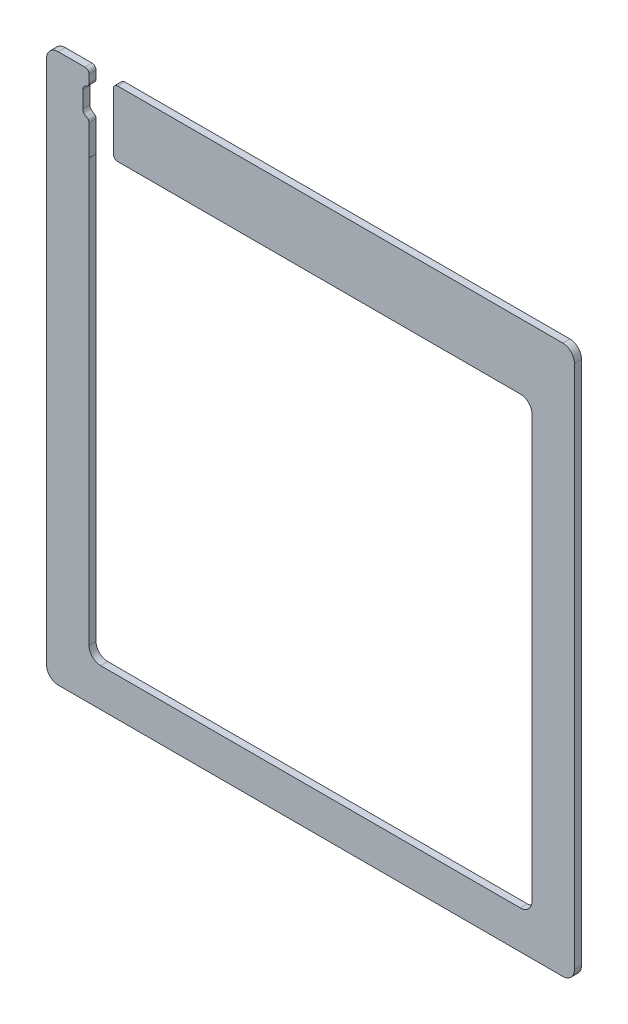
ISO-10303-21;
HEADER;
FILE_DESCRIPTION(('STEP AP214'),'2;1');
FILE_NAME('part.step','',(''),(''),'','','');
FILE_SCHEMA(('AUTOMOTIVE_DESIGN { 1 0 10303 214 1 1 1 1 }'));
ENDSEC;
DATA;
#1=APPLICATION_CONTEXT('core data for automotive mechanical design processes');
#2=APPLICATION_PROTOCOL_DEFINITION('international standard','automotive_design',2000,#1);
#3=PRODUCT_CONTEXT('',#1,'mechanical');
#4=PRODUCT('Part','Part','',(#3));
#5=PRODUCT_RELATED_PRODUCT_CATEGORY('part','',(#4));
#6=PRODUCT_DEFINITION_FORMATION('','',#4);
#7=PRODUCT_DEFINITION_CONTEXT('part definition',#1,'design');
#8=PRODUCT_DEFINITION('design','',#6,#7);
#9=PRODUCT_DEFINITION_SHAPE('','',#8);
#10=(LENGTH_UNIT() NAMED_UNIT(*) SI_UNIT(.MILLI.,.METRE.));
#11=(NAMED_UNIT(*) PLANE_ANGLE_UNIT() SI_UNIT($,.RADIAN.));
#12=(NAMED_UNIT(*) SI_UNIT($,.STERADIAN.) SOLID_ANGLE_UNIT());
#13=UNCERTAINTY_MEASURE_WITH_UNIT(LENGTH_MEASURE(1.E-05),#10,'distance_accuracy_value','');
#14=(GEOMETRIC_REPRESENTATION_CONTEXT(3) GLOBAL_UNCERTAINTY_ASSIGNED_CONTEXT((#13)) GLOBAL_UNIT_ASSIGNED_CONTEXT((#10,
#11,#12)) REPRESENTATION_CONTEXT('',''));
#15=CARTESIAN_POINT('',(0.,0.,0.));
#16=DIRECTION('',(0.,0.,1.));
#17=DIRECTION('',(1.,0.,0.));
#18=AXIS2_PLACEMENT_3D('',#15,#16,#17);
#19=CARTESIAN_POINT('',(-161.925,168.275,4.3434));
#20=DIRECTION('',(0.,-1.,0.));
#21=DIRECTION('',(0.,0.,-1.));
#22=AXIS2_PLACEMENT_3D('',#19,#20,#21);
#23=PLANE('',#22);
#24=DIRECTION('',(-1.,0.,0.));
#25=VECTOR('',#24,1.);
#26=CARTESIAN_POINT('',(-161.925,168.275,4.3434));
#27=LINE('',#26,#25);
#28=CARTESIAN_POINT('',(-138.43,168.275,4.3434));
#29=VERTEX_POINT('',#28);
#30=CARTESIAN_POINT('',(-154.78125,168.275,4.3434));
#31=VERTEX_POINT('',#30);
#32=EDGE_CURVE('E356',#29,#31,#27,.T.);
#33=ORIENTED_EDGE('',*,*,#32,.F.);
#34=DIRECTION('',(0.,0.,1.));
#35=VECTOR('',#34,1.);
#36=CARTESIAN_POINT('',(-138.43,168.275,4.3434));
#37=LINE('',#36,#35);
#38=CARTESIAN_POINT('',(-138.43,168.275,0.));
#39=VERTEX_POINT('',#38);
#40=EDGE_CURVE('E490',#29,#39,#37,.F.);
#41=ORIENTED_EDGE('',*,*,#40,.T.);
#42=DIRECTION('',(-1.,0.,0.));
#43=VECTOR('',#42,1.);
#44=CARTESIAN_POINT('',(-161.925,168.275,0.));
#45=LINE('',#44,#43);
#46=CARTESIAN_POINT('',(-154.78125,168.275,0.));
#47=VERTEX_POINT('',#46);
#48=EDGE_CURVE('E369',#39,#47,#45,.T.);
#49=ORIENTED_EDGE('',*,*,#48,.T.);
#50=DIRECTION('',(0.,0.,-1.));
#51=VECTOR('',#50,1.);
#52=CARTESIAN_POINT('',(-154.78125,168.275,4.3434));
#53=LINE('',#52,#51);
#54=EDGE_CURVE('E428',#47,#31,#53,.F.);
#55=ORIENTED_EDGE('',*,*,#54,.T.);
#56=EDGE_LOOP('',(#33,#41,#49,#55));
#57=FACE_BOUND('',#56,.T.);
#58=ADVANCED_FACE('F37',(#57),#23,.F.);
#59=CARTESIAN_POINT('',(161.925,-168.275,4.3434));
#60=DIRECTION('',(-1.,0.,0.));
#61=DIRECTION('',(0.,0.,1.));
#62=AXIS2_PLACEMENT_3D('',#59,#60,#61);
#63=PLANE('',#62);
#64=DIRECTION('',(0.,1.,0.));
#65=VECTOR('',#64,1.);
#66=CARTESIAN_POINT('',(161.925,-168.275,4.3434));
#67=LINE('',#66,#65);
#68=CARTESIAN_POINT('',(161.925,-161.13125,4.3434));
#69=VERTEX_POINT('',#68);
#70=CARTESIAN_POINT('',(161.925,161.13125,4.3434));
#71=VERTEX_POINT('',#70);
#72=EDGE_CURVE('E353',#69,#71,#67,.T.);
#73=ORIENTED_EDGE('',*,*,#72,.F.);
#74=DIRECTION('',(0.,0.,-1.));
#75=VECTOR('',#74,1.);
#76=CARTESIAN_POINT('',(161.925,-161.13125,4.3434));
#77=LINE('',#76,#75);
#78=CARTESIAN_POINT('',(161.925,-161.13125,0.));
#79=VERTEX_POINT('',#78);
#80=EDGE_CURVE('E425',#69,#79,#77,.T.);
#81=ORIENTED_EDGE('',*,*,#80,.T.);
#82=DIRECTION('',(0.,1.,0.));
#83=VECTOR('',#82,1.);
#84=CARTESIAN_POINT('',(161.925,-168.275,0.));
#85=LINE('',#84,#83);
#86=CARTESIAN_POINT('',(161.925,161.13125,0.));
#87=VERTEX_POINT('',#86);
#88=EDGE_CURVE('E342',#79,#87,#85,.T.);
#89=ORIENTED_EDGE('',*,*,#88,.T.);
#90=DIRECTION('',(0.,0.,-1.));
#91=VECTOR('',#90,1.);
#92=CARTESIAN_POINT('',(161.925,161.13125,4.3434));
#93=LINE('',#92,#91);
#94=EDGE_CURVE('E423',#87,#71,#93,.F.);
#95=ORIENTED_EDGE('',*,*,#94,.T.);
#96=EDGE_LOOP('',(#73,#81,#89,#95));
#97=FACE_BOUND('',#96,.T.);
#98=ADVANCED_FACE('F598',(#97),#63,.F.);
#99=CARTESIAN_POINT('',(154.78125,168.275,0.));
#100=VERTEX_POINT('',#99);
#101=CARTESIAN_POINT('',(-118.370344445739,168.275,0.));
#102=VERTEX_POINT('',#101);
#103=EDGE_CURVE('E370',#100,#102,#45,.T.);
#104=ORIENTED_EDGE('',*,*,#103,.T.);
#105=DIRECTION('',(0.,0.,1.));
#106=VECTOR('',#105,1.);
#107=CARTESIAN_POINT('',(-118.370344445739,168.275,4.3434));
#108=LINE('',#107,#106);
#109=CARTESIAN_POINT('',(-118.370344445739,168.275,4.3434));
#110=VERTEX_POINT('',#109);
#111=EDGE_CURVE('E492',#102,#110,#108,.T.);
#112=ORIENTED_EDGE('',*,*,#111,.T.);
#113=CARTESIAN_POINT('',(154.78125,168.275,4.3434));
#114=VERTEX_POINT('',#113);
#115=EDGE_CURVE('E358',#114,#110,#27,.T.);
#116=ORIENTED_EDGE('',*,*,#115,.F.);
#117=DIRECTION('',(0.,0.,-1.));
#118=VECTOR('',#117,1.);
#119=CARTESIAN_POINT('',(154.78125,168.275,4.3434));
#120=LINE('',#119,#118);
#121=EDGE_CURVE('E431',#114,#100,#120,.T.);
#122=ORIENTED_EDGE('',*,*,#121,.T.);
#123=EDGE_LOOP('',(#104,#112,#116,#122));
#124=FACE_BOUND('',#123,.T.);
#125=ADVANCED_FACE('F606',(#124),#23,.F.);
#126=CARTESIAN_POINT('',(-161.925,-168.275,4.3434));
#127=DIRECTION('',(1.,0.,0.));
#128=DIRECTION('',(0.,0.,-1.));
#129=AXIS2_PLACEMENT_3D('',#126,#127,#128);
#130=PLANE('',#129);
#131=DIRECTION('',(0.,-1.,0.));
#132=VECTOR('',#131,1.);
#133=CARTESIAN_POINT('',(-161.925,-168.275,0.));
#134=LINE('',#133,#132);
#135=CARTESIAN_POINT('',(-161.925,161.13125,0.));
#136=VERTEX_POINT('',#135);
#137=CARTESIAN_POINT('',(-161.925,-161.13125,0.));
#138=VERTEX_POINT('',#137);
#139=EDGE_CURVE('E373',#136,#138,#134,.T.);
#140=ORIENTED_EDGE('',*,*,#139,.T.);
#141=DIRECTION('',(0.,0.,-1.));
#142=VECTOR('',#141,1.);
#143=CARTESIAN_POINT('',(-161.925,-161.13125,4.3434));
#144=LINE('',#143,#142);
#145=CARTESIAN_POINT('',(-161.925,-161.13125,4.3434));
#146=VERTEX_POINT('',#145);
#147=EDGE_CURVE('E413',#138,#146,#144,.F.);
#148=ORIENTED_EDGE('',*,*,#147,.T.);
#149=DIRECTION('',(0.,-1.,0.));
#150=VECTOR('',#149,1.);
#151=CARTESIAN_POINT('',(-161.925,-168.275,4.3434));
#152=LINE('',#151,#150);
#153=CARTESIAN_POINT('',(-161.925,161.13125,4.3434));
#154=VERTEX_POINT('',#153);
#155=EDGE_CURVE('E360',#154,#146,#152,.T.);
#156=ORIENTED_EDGE('',*,*,#155,.F.);
#157=DIRECTION('',(0.,0.,-1.));
#158=VECTOR('',#157,1.);
#159=CARTESIAN_POINT('',(-161.925,161.13125,4.3434));
#160=LINE('',#159,#158);
#161=EDGE_CURVE('E410',#154,#136,#160,.T.);
#162=ORIENTED_EDGE('',*,*,#161,.T.);
#163=EDGE_LOOP('',(#140,#148,#156,#162));
#164=FACE_BOUND('',#163,.T.);
#165=ADVANCED_FACE('F580',(#164),#130,.F.);
#166=CARTESIAN_POINT('',(-161.925,-168.275,4.3434));
#167=DIRECTION('',(0.,1.,0.));
#168=DIRECTION('',(0.,0.,1.));
#169=AXIS2_PLACEMENT_3D('',#166,#167,#168);
#170=PLANE('',#169);
#171=DIRECTION('',(1.,0.,0.));
#172=VECTOR('',#171,1.);
#173=CARTESIAN_POINT('',(-161.925,-168.275,4.3434));
#174=LINE('',#173,#172);
#175=CARTESIAN_POINT('',(-154.78125,-168.275,4.3434));
#176=VERTEX_POINT('',#175);
#177=CARTESIAN_POINT('',(154.78125,-168.275,4.3434));
#178=VERTEX_POINT('',#177);
#179=EDGE_CURVE('E363',#176,#178,#174,.T.);
#180=ORIENTED_EDGE('',*,*,#179,.F.);
#181=DIRECTION('',(0.,0.,-1.));
#182=VECTOR('',#181,1.);
#183=CARTESIAN_POINT('',(-154.78125,-168.275,4.3434));
#184=LINE('',#183,#182);
#185=CARTESIAN_POINT('',(-154.78125,-168.275,0.));
#186=VERTEX_POINT('',#185);
#187=EDGE_CURVE('E398',#176,#186,#184,.T.);
#188=ORIENTED_EDGE('',*,*,#187,.T.);
#189=DIRECTION('',(1.,0.,0.));
#190=VECTOR('',#189,1.);
#191=CARTESIAN_POINT('',(-161.925,-168.275,0.));
#192=LINE('',#191,#190);
#193=CARTESIAN_POINT('',(154.78125,-168.275,0.));
#194=VERTEX_POINT('',#193);
#195=EDGE_CURVE('E357',#186,#194,#192,.T.);
#196=ORIENTED_EDGE('',*,*,#195,.T.);
#197=DIRECTION('',(0.,0.,-1.));
#198=VECTOR('',#197,1.);
#199=CARTESIAN_POINT('',(154.78125,-168.275,4.3434));
#200=LINE('',#199,#198);
#201=EDGE_CURVE('E396',#194,#178,#200,.F.);
#202=ORIENTED_EDGE('',*,*,#201,.T.);
#203=EDGE_LOOP('',(#180,#188,#196,#202));
#204=FACE_BOUND('',#203,.T.);
#205=ADVANCED_FACE('F589',(#204),#170,.F.);
#206=CARTESIAN_POINT('',(0.,0.,4.3434));
#207=DIRECTION('',(0.,0.,-1.));
#208=DIRECTION('',(-1.,0.,0.));
#209=AXIS2_PLACEMENT_3D('',#206,#207,#208);
#210=PLANE('',#209);
#211=DIRECTION('',(0.,-1.,0.));
#212=VECTOR('',#211,1.);
#213=CARTESIAN_POINT('',(-135.89,168.275,4.3434));
#214=LINE('',#213,#212);
#215=CARTESIAN_POINT('',(-135.89,140.026846327358,4.3434));
#216=VERTEX_POINT('',#215);
#217=CARTESIAN_POINT('',(-135.89,121.34990390463,4.3434));
#218=VERTEX_POINT('',#217);
#219=EDGE_CURVE('E270',#216,#218,#214,.T.);
#220=ORIENTED_EDGE('',*,*,#219,.F.);
#221=CARTESIAN_POINT('',(-138.43,140.026846327358,4.3434));
#222=DIRECTION('',(0.,0.,-1.));
#223=DIRECTION('',(-1.,0.,0.));
#224=AXIS2_PLACEMENT_3D('',#221,#222,#223);
#225=CIRCLE('',#224,2.54);
#226=CARTESIAN_POINT('',(-137.583333333333,142.421581292977,4.3434));
#227=VERTEX_POINT('',#226);
#228=EDGE_CURVE('E481',#216,#227,#225,.F.);
#229=ORIENTED_EDGE('',*,*,#228,.T.);
#230=CARTESIAN_POINT('',(-136.525,145.415,4.3434));
#231=DIRECTION('',(0.,0.,1.));
#232=DIRECTION('',(1.,0.,0.));
#233=AXIS2_PLACEMENT_3D('',#230,#231,#232);
#234=CIRCLE('',#233,3.17500000000001);
#235=CARTESIAN_POINT('',(-139.7,145.415,4.3434));
#236=VERTEX_POINT('',#235);
#237=EDGE_CURVE('E274',#236,#227,#234,.T.);
#238=ORIENTED_EDGE('',*,*,#237,.F.);
#239=DIRECTION('',(0.,-1.,0.));
#240=VECTOR('',#239,1.);
#241=CARTESIAN_POINT('',(-139.7,145.415,4.3434));
#242=LINE('',#241,#240);
#243=CARTESIAN_POINT('',(-139.7,155.575,4.3434));
#244=VERTEX_POINT('',#243);
#245=EDGE_CURVE('E303',#244,#236,#242,.T.);
#246=ORIENTED_EDGE('',*,*,#245,.F.);
#247=CARTESIAN_POINT('',(-136.525,155.575,4.3434));
#248=DIRECTION('',(0.,0.,1.));
#249=DIRECTION('',(1.,0.,0.));
#250=AXIS2_PLACEMENT_3D('',#247,#248,#249);
#251=CIRCLE('',#250,3.17500000000001);
#252=CARTESIAN_POINT('',(-137.583333333333,158.568418707023,4.3434));
#253=VERTEX_POINT('',#252);
#254=EDGE_CURVE('E314',#253,#244,#251,.T.);
#255=ORIENTED_EDGE('',*,*,#254,.F.);
#256=CARTESIAN_POINT('',(-138.43,160.963153672642,4.3434));
#257=DIRECTION('',(0.,0.,-1.));
#258=DIRECTION('',(-1.,0.,0.));
#259=AXIS2_PLACEMENT_3D('',#256,#257,#258);
#260=CIRCLE('',#259,2.54);
#261=CARTESIAN_POINT('',(-135.89,160.963153672642,4.3434));
#262=VERTEX_POINT('',#261);
#263=EDGE_CURVE('E473',#253,#262,#260,.F.);
#264=ORIENTED_EDGE('',*,*,#263,.T.);
#265=CARTESIAN_POINT('',(-135.89,165.735,4.3434));
#266=VERTEX_POINT('',#265);
#267=EDGE_CURVE('E290',#266,#262,#214,.T.);
#268=ORIENTED_EDGE('',*,*,#267,.F.);
#269=CARTESIAN_POINT('',(-138.43,165.735,4.3434));
#270=DIRECTION('',(0.,0.,-1.));
#271=DIRECTION('',(-1.,0.,0.));
#272=AXIS2_PLACEMENT_3D('',#269,#270,#271);
#273=CIRCLE('',#272,2.54);
#274=EDGE_CURVE('E479',#266,#29,#273,.F.);
#275=ORIENTED_EDGE('',*,*,#274,.T.);
#276=ORIENTED_EDGE('',*,*,#32,.T.);
#277=CARTESIAN_POINT('',(-154.78125,161.13125,4.3434));
#278=DIRECTION('',(0.,0.,-1.));
#279=DIRECTION('',(-1.,0.,0.));
#280=AXIS2_PLACEMENT_3D('',#277,#278,#279);
#281=CIRCLE('',#280,7.14375);
#282=EDGE_CURVE('E415',#31,#154,#281,.F.);
#283=ORIENTED_EDGE('',*,*,#282,.T.);
#284=ORIENTED_EDGE('',*,*,#155,.T.);
#285=CARTESIAN_POINT('',(-154.78125,-161.13125,4.3434));
#286=DIRECTION('',(0.,0.,-1.));
#287=DIRECTION('',(-1.,0.,0.));
#288=AXIS2_PLACEMENT_3D('',#285,#286,#287);
#289=CIRCLE('',#288,7.14375);
#290=EDGE_CURVE('E421',#146,#176,#289,.F.);
#291=ORIENTED_EDGE('',*,*,#290,.T.);
#292=ORIENTED_EDGE('',*,*,#179,.T.);
#293=CARTESIAN_POINT('',(154.78125,-161.13125,4.3434));
#294=DIRECTION('',(0.,0.,-1.));
#295=DIRECTION('',(-1.,0.,0.));
#296=AXIS2_PLACEMENT_3D('',#293,#294,#295);
#297=CIRCLE('',#296,7.14375);
#298=EDGE_CURVE('E419',#178,#69,#297,.F.);
#299=ORIENTED_EDGE('',*,*,#298,.T.);
#300=ORIENTED_EDGE('',*,*,#72,.T.);
#301=CARTESIAN_POINT('',(154.78125,161.13125,4.3434));
#302=DIRECTION('',(0.,0.,-1.));
#303=DIRECTION('',(-1.,0.,0.));
#304=AXIS2_PLACEMENT_3D('',#301,#302,#303);
#305=CIRCLE('',#304,7.14375);
#306=EDGE_CURVE('E417',#71,#114,#305,.F.);
#307=ORIENTED_EDGE('',*,*,#306,.T.);
#308=ORIENTED_EDGE('',*,*,#115,.T.);
#309=CARTESIAN_POINT('',(-118.370344445739,165.735,4.3434));
#310=DIRECTION('',(0.,0.,-1.));
#311=DIRECTION('',(-1.,0.,0.));
#312=AXIS2_PLACEMENT_3D('',#309,#310,#311);
#313=CIRCLE('',#312,2.54);
#314=CARTESIAN_POINT('',(-120.910344445739,165.735,4.3434));
#315=VERTEX_POINT('',#314);
#316=EDGE_CURVE('E62',#110,#315,#313,.F.);
#317=ORIENTED_EDGE('',*,*,#316,.T.);
#318=DIRECTION('',(0.,1.,0.));
#319=VECTOR('',#318,1.);
#320=CARTESIAN_POINT('',(-120.910344445739,168.275,4.3434));
#321=LINE('',#320,#319);
#322=CARTESIAN_POINT('',(-120.910344445739,130.683,4.3434));
#323=VERTEX_POINT('',#322);
#324=EDGE_CURVE('E264',#323,#315,#321,.T.);
#325=ORIENTED_EDGE('',*,*,#324,.F.);
#326=CARTESIAN_POINT('',(-118.370344445739,130.683,4.3434));
#327=DIRECTION('',(0.,0.,-1.));
#328=DIRECTION('',(-1.,0.,0.));
#329=AXIS2_PLACEMENT_3D('',#326,#327,#328);
#330=CIRCLE('',#329,2.54);
#331=CARTESIAN_POINT('',(-118.370344445739,128.143,4.3434));
#332=VERTEX_POINT('',#331);
#333=EDGE_CURVE('E56',#323,#332,#330,.F.);
#334=ORIENTED_EDGE('',*,*,#333,.T.);
#335=DIRECTION('',(-1.,0.,0.));
#336=VECTOR('',#335,1.);
#337=CARTESIAN_POINT('',(-135.89,128.143,4.3434));
#338=LINE('',#337,#336);
#339=CARTESIAN_POINT('',(128.74625,128.143,4.3434));
#340=VERTEX_POINT('',#339);
#341=EDGE_CURVE('E345',#340,#332,#338,.T.);
#342=ORIENTED_EDGE('',*,*,#341,.F.);
#343=CARTESIAN_POINT('',(128.74625,120.99925,4.3434));
#344=DIRECTION('',(0.,0.,-1.));
#345=DIRECTION('',(-1.,0.,0.));
#346=AXIS2_PLACEMENT_3D('',#343,#344,#345);
#347=CIRCLE('',#346,7.14375);
#348=CARTESIAN_POINT('',(135.89,120.99925,4.3434));
#349=VERTEX_POINT('',#348);
#350=EDGE_CURVE('E438',#340,#349,#347,.T.);
#351=ORIENTED_EDGE('',*,*,#350,.T.);
#352=DIRECTION('',(0.,1.,0.));
#353=VECTOR('',#352,1.);
#354=CARTESIAN_POINT('',(135.89,-144.907,4.3434));
#355=LINE('',#354,#353);
#356=CARTESIAN_POINT('',(135.89,-137.76325,4.3434));
#357=VERTEX_POINT('',#356);
#358=EDGE_CURVE('E323',#357,#349,#355,.T.);
#359=ORIENTED_EDGE('',*,*,#358,.F.);
#360=CARTESIAN_POINT('',(128.74625,-137.76325,4.3434));
#361=DIRECTION('',(0.,0.,-1.));
#362=DIRECTION('',(-1.,0.,0.));
#363=AXIS2_PLACEMENT_3D('',#360,#361,#362);
#364=CIRCLE('',#363,7.14375);
#365=CARTESIAN_POINT('',(128.74625,-144.907,4.3434));
#366=VERTEX_POINT('',#365);
#367=EDGE_CURVE('E434',#357,#366,#364,.T.);
#368=ORIENTED_EDGE('',*,*,#367,.T.);
#369=DIRECTION('',(1.,0.,0.));
#370=VECTOR('',#369,1.);
#371=CARTESIAN_POINT('',(-135.89,-144.907,4.3434));
#372=LINE('',#371,#370);
#373=CARTESIAN_POINT('',(-128.74625,-144.907,4.3434));
#374=VERTEX_POINT('',#373);
#375=EDGE_CURVE('E331',#374,#366,#372,.T.);
#376=ORIENTED_EDGE('',*,*,#375,.F.);
#377=CARTESIAN_POINT('',(-128.74625,-137.76325,4.3434));
#378=DIRECTION('',(0.,0.,-1.));
#379=DIRECTION('',(-1.,0.,0.));
#380=AXIS2_PLACEMENT_3D('',#377,#378,#379);
#381=CIRCLE('',#380,7.14375);
#382=CARTESIAN_POINT('',(-135.89,-137.76325,4.3434));
#383=VERTEX_POINT('',#382);
#384=EDGE_CURVE('E448',#374,#383,#381,.T.);
#385=ORIENTED_EDGE('',*,*,#384,.T.);
#386=DIRECTION('',(0.,-1.,0.));
#387=VECTOR('',#386,1.);
#388=CARTESIAN_POINT('',(-135.89,-144.907,4.3434));
#389=LINE('',#388,#387);
#390=CARTESIAN_POINT('',(-135.89,120.99925,4.3434));
#391=VERTEX_POINT('',#390);
#392=EDGE_CURVE('E348',#391,#383,#389,.T.);
#393=ORIENTED_EDGE('',*,*,#392,.F.);
#394=CARTESIAN_POINT('',(-128.74625,120.99925,4.3434));
#395=DIRECTION('',(0.,0.,-1.));
#396=DIRECTION('',(-1.,0.,0.));
#397=AXIS2_PLACEMENT_3D('',#394,#395,#396);
#398=CIRCLE('',#397,7.14375);
#399=CARTESIAN_POINT('',(-135.881388814464,121.34990390463,4.3434));
#400=VERTEX_POINT('',#399);
#401=EDGE_CURVE('E442',#391,#400,#398,.T.);
#402=ORIENTED_EDGE('',*,*,#401,.T.);
#403=DIRECTION('',(1.,0.,0.));
#404=VECTOR('',#403,1.);
#405=CARTESIAN_POINT('',(-135.89,121.34990390463,4.3434));
#406=LINE('',#405,#404);
#407=EDGE_CURVE('E294',#218,#400,#406,.T.);
#408=ORIENTED_EDGE('',*,*,#407,.F.);
#409=EDGE_LOOP('',(#220,#229,#238,#246,#255,#264,#268,#275,#276,#283,#284,#291,#292,#299,#300,
#307,#308,#317,#325,#334,#342,#351,#359,#368,#376,#385,#393,#402,#408));
#410=FACE_BOUND('',#409,.T.);
#411=ADVANCED_FACE('F513',(#410),#210,.F.);
#412=CARTESIAN_POINT('',(0.,0.,0.));
#413=DIRECTION('',(0.,0.,-1.));
#414=DIRECTION('',(-1.,0.,0.));
#415=AXIS2_PLACEMENT_3D('',#412,#413,#414);
#416=PLANE('',#415);
#417=CARTESIAN_POINT('',(-136.525,145.415,0.));
#418=DIRECTION('',(0.,0.,1.));
#419=DIRECTION('',(1.,0.,0.));
#420=AXIS2_PLACEMENT_3D('',#417,#418,#419);
#421=CIRCLE('',#420,3.17500000000001);
#422=CARTESIAN_POINT('',(-139.7,145.415,0.));
#423=VERTEX_POINT('',#422);
#424=CARTESIAN_POINT('',(-137.583333333333,142.421581292977,0.));
#425=VERTEX_POINT('',#424);
#426=EDGE_CURVE('E299',#423,#425,#421,.T.);
#427=ORIENTED_EDGE('',*,*,#426,.T.);
#428=CARTESIAN_POINT('',(-138.43,140.026846327358,0.));
#429=DIRECTION('',(0.,0.,-1.));
#430=DIRECTION('',(-1.,0.,0.));
#431=AXIS2_PLACEMENT_3D('',#428,#429,#430);
#432=CIRCLE('',#431,2.54);
#433=CARTESIAN_POINT('',(-135.89,140.026846327358,0.));
#434=VERTEX_POINT('',#433);
#435=EDGE_CURVE('E259',#425,#434,#432,.T.);
#436=ORIENTED_EDGE('',*,*,#435,.T.);
#437=DIRECTION('',(0.,-1.,0.));
#438=VECTOR('',#437,1.);
#439=CARTESIAN_POINT('',(-135.89,168.275,0.));
#440=LINE('',#439,#438);
#441=CARTESIAN_POINT('',(-135.89,121.34990390463,0.));
#442=VERTEX_POINT('',#441);
#443=EDGE_CURVE('E252',#434,#442,#440,.T.);
#444=ORIENTED_EDGE('',*,*,#443,.T.);
#445=DIRECTION('',(1.,0.,0.));
#446=VECTOR('',#445,1.);
#447=CARTESIAN_POINT('',(-135.89,121.34990390463,0.));
#448=LINE('',#447,#446);
#449=CARTESIAN_POINT('',(-135.881388814464,121.34990390463,0.));
#450=VERTEX_POINT('',#449);
#451=EDGE_CURVE('E257',#442,#450,#448,.T.);
#452=ORIENTED_EDGE('',*,*,#451,.T.);
#453=CARTESIAN_POINT('',(-128.74625,120.99925,0.));
#454=DIRECTION('',(0.,0.,-1.));
#455=DIRECTION('',(-1.,0.,0.));
#456=AXIS2_PLACEMENT_3D('',#453,#454,#455);
#457=CIRCLE('',#456,7.14375);
#458=CARTESIAN_POINT('',(-135.89,120.99925,0.));
#459=VERTEX_POINT('',#458);
#460=EDGE_CURVE('E446',#450,#459,#457,.F.);
#461=ORIENTED_EDGE('',*,*,#460,.T.);
#462=DIRECTION('',(0.,-1.,0.));
#463=VECTOR('',#462,1.);
#464=CARTESIAN_POINT('',(-135.89,-144.907,0.));
#465=LINE('',#464,#463);
#466=CARTESIAN_POINT('',(-135.89,-137.76325,0.));
#467=VERTEX_POINT('',#466);
#468=EDGE_CURVE('E335',#459,#467,#465,.T.);
#469=ORIENTED_EDGE('',*,*,#468,.T.);
#470=CARTESIAN_POINT('',(-128.74625,-137.76325,0.));
#471=DIRECTION('',(0.,0.,-1.));
#472=DIRECTION('',(-1.,0.,0.));
#473=AXIS2_PLACEMENT_3D('',#470,#471,#472);
#474=CIRCLE('',#473,7.14375);
#475=CARTESIAN_POINT('',(-128.74625,-144.907,0.));
#476=VERTEX_POINT('',#475);
#477=EDGE_CURVE('E450',#467,#476,#474,.F.);
#478=ORIENTED_EDGE('',*,*,#477,.T.);
#479=DIRECTION('',(1.,0.,0.));
#480=VECTOR('',#479,1.);
#481=CARTESIAN_POINT('',(-135.89,-144.907,0.));
#482=LINE('',#481,#480);
#483=CARTESIAN_POINT('',(128.74625,-144.907,0.));
#484=VERTEX_POINT('',#483);
#485=EDGE_CURVE('E339',#476,#484,#482,.T.);
#486=ORIENTED_EDGE('',*,*,#485,.T.);
#487=CARTESIAN_POINT('',(128.74625,-137.76325,0.));
#488=DIRECTION('',(0.,0.,-1.));
#489=DIRECTION('',(-1.,0.,0.));
#490=AXIS2_PLACEMENT_3D('',#487,#488,#489);
#491=CIRCLE('',#490,7.14375);
#492=CARTESIAN_POINT('',(135.89,-137.76325,0.));
#493=VERTEX_POINT('',#492);
#494=EDGE_CURVE('E436',#484,#493,#491,.F.);
#495=ORIENTED_EDGE('',*,*,#494,.T.);
#496=DIRECTION('',(0.,1.,0.));
#497=VECTOR('',#496,1.);
#498=CARTESIAN_POINT('',(135.89,-144.907,0.));
#499=LINE('',#498,#497);
#500=CARTESIAN_POINT('',(135.89,120.99925,0.));
#501=VERTEX_POINT('',#500);
#502=EDGE_CURVE('E327',#493,#501,#499,.T.);
#503=ORIENTED_EDGE('',*,*,#502,.T.);
#504=CARTESIAN_POINT('',(128.74625,120.99925,0.));
#505=DIRECTION('',(0.,0.,-1.));
#506=DIRECTION('',(-1.,0.,0.));
#507=AXIS2_PLACEMENT_3D('',#504,#505,#506);
#508=CIRCLE('',#507,7.14375);
#509=CARTESIAN_POINT('',(128.74625,128.143,0.));
#510=VERTEX_POINT('',#509);
#511=EDGE_CURVE('E440',#501,#510,#508,.F.);
#512=ORIENTED_EDGE('',*,*,#511,.T.);
#513=DIRECTION('',(-1.,0.,0.));
#514=VECTOR('',#513,1.);
#515=CARTESIAN_POINT('',(-135.89,128.143,0.));
#516=LINE('',#515,#514);
#517=CARTESIAN_POINT('',(-118.370344445739,128.143,0.));
#518=VERTEX_POINT('',#517);
#519=EDGE_CURVE('E330',#510,#518,#516,.T.);
#520=ORIENTED_EDGE('',*,*,#519,.T.);
#521=CARTESIAN_POINT('',(-118.370344445739,130.683,0.));
#522=DIRECTION('',(0.,0.,-1.));
#523=DIRECTION('',(-1.,0.,0.));
#524=AXIS2_PLACEMENT_3D('',#521,#522,#523);
#525=CIRCLE('',#524,2.54);
#526=CARTESIAN_POINT('',(-120.910344445739,130.683,0.));
#527=VERTEX_POINT('',#526);
#528=EDGE_CURVE('E461',#518,#527,#525,.T.);
#529=ORIENTED_EDGE('',*,*,#528,.T.);
#530=DIRECTION('',(0.,1.,0.));
#531=VECTOR('',#530,1.);
#532=CARTESIAN_POINT('',(-120.910344445739,168.275,0.));
#533=LINE('',#532,#531);
#534=CARTESIAN_POINT('',(-120.910344445739,165.735,0.));
#535=VERTEX_POINT('',#534);
#536=EDGE_CURVE('E275',#527,#535,#533,.T.);
#537=ORIENTED_EDGE('',*,*,#536,.T.);
#538=CARTESIAN_POINT('',(-118.370344445739,165.735,0.));
#539=DIRECTION('',(0.,0.,-1.));
#540=DIRECTION('',(-1.,0.,0.));
#541=AXIS2_PLACEMENT_3D('',#538,#539,#540);
#542=CIRCLE('',#541,2.54);
#543=EDGE_CURVE('E464',#535,#102,#542,.T.);
#544=ORIENTED_EDGE('',*,*,#543,.T.);
#545=ORIENTED_EDGE('',*,*,#103,.F.);
#546=CARTESIAN_POINT('',(154.78125,161.13125,0.));
#547=DIRECTION('',(0.,0.,-1.));
#548=DIRECTION('',(-1.,0.,0.));
#549=AXIS2_PLACEMENT_3D('',#546,#547,#548);
#550=CIRCLE('',#549,7.14375);
#551=EDGE_CURVE('E404',#100,#87,#550,.T.);
#552=ORIENTED_EDGE('',*,*,#551,.T.);
#553=ORIENTED_EDGE('',*,*,#88,.F.);
#554=CARTESIAN_POINT('',(154.78125,-161.13125,0.));
#555=DIRECTION('',(0.,0.,-1.));
#556=DIRECTION('',(-1.,0.,0.));
#557=AXIS2_PLACEMENT_3D('',#554,#555,#556);
#558=CIRCLE('',#557,7.14375);
#559=EDGE_CURVE('E406',#79,#194,#558,.T.);
#560=ORIENTED_EDGE('',*,*,#559,.T.);
#561=ORIENTED_EDGE('',*,*,#195,.F.);
#562=CARTESIAN_POINT('',(-154.78125,-161.13125,0.));
#563=DIRECTION('',(0.,0.,-1.));
#564=DIRECTION('',(-1.,0.,0.));
#565=AXIS2_PLACEMENT_3D('',#562,#563,#564);
#566=CIRCLE('',#565,7.14375);
#567=EDGE_CURVE('E408',#186,#138,#566,.T.);
#568=ORIENTED_EDGE('',*,*,#567,.T.);
#569=ORIENTED_EDGE('',*,*,#139,.F.);
#570=CARTESIAN_POINT('',(-154.78125,161.13125,0.));
#571=DIRECTION('',(0.,0.,-1.));
#572=DIRECTION('',(-1.,0.,0.));
#573=AXIS2_PLACEMENT_3D('',#570,#571,#572);
#574=CIRCLE('',#573,7.14375);
#575=EDGE_CURVE('E401',#136,#47,#574,.T.);
#576=ORIENTED_EDGE('',*,*,#575,.T.);
#577=ORIENTED_EDGE('',*,*,#48,.F.);
#578=CARTESIAN_POINT('',(-138.43,165.735,0.));
#579=DIRECTION('',(0.,0.,-1.));
#580=DIRECTION('',(-1.,0.,0.));
#581=AXIS2_PLACEMENT_3D('',#578,#579,#580);
#582=CIRCLE('',#581,2.54);
#583=CARTESIAN_POINT('',(-135.89,165.735,0.));
#584=VERTEX_POINT('',#583);
#585=EDGE_CURVE('E466',#39,#584,#582,.T.);
#586=ORIENTED_EDGE('',*,*,#585,.T.);
#587=CARTESIAN_POINT('',(-135.89,160.963153672642,0.));
#588=VERTEX_POINT('',#587);
#589=EDGE_CURVE('E263',#584,#588,#440,.T.);
#590=ORIENTED_EDGE('',*,*,#589,.T.);
#591=CARTESIAN_POINT('',(-138.43,160.963153672642,0.));
#592=DIRECTION('',(0.,0.,-1.));
#593=DIRECTION('',(-1.,0.,0.));
#594=AXIS2_PLACEMENT_3D('',#591,#592,#593);
#595=CIRCLE('',#594,2.54);
#596=CARTESIAN_POINT('',(-137.583333333333,158.568418707023,0.));
#597=VERTEX_POINT('',#596);
#598=EDGE_CURVE('E458',#588,#597,#595,.T.);
#599=ORIENTED_EDGE('',*,*,#598,.T.);
#600=CARTESIAN_POINT('',(-136.525,155.575,0.));
#601=DIRECTION('',(0.,0.,1.));
#602=DIRECTION('',(1.,0.,0.));
#603=AXIS2_PLACEMENT_3D('',#600,#601,#602);
#604=CIRCLE('',#603,3.17500000000001);
#605=CARTESIAN_POINT('',(-139.7,155.575,0.));
#606=VERTEX_POINT('',#605);
#607=EDGE_CURVE('E302',#597,#606,#604,.T.);
#608=ORIENTED_EDGE('',*,*,#607,.T.);
#609=DIRECTION('',(0.,-1.,0.));
#610=VECTOR('',#609,1.);
#611=CARTESIAN_POINT('',(-139.7,145.415,0.));
#612=LINE('',#611,#610);
#613=EDGE_CURVE('E306',#606,#423,#612,.T.);
#614=ORIENTED_EDGE('',*,*,#613,.T.);
#615=EDGE_LOOP('',(#427,#436,#444,#452,#461,#469,#478,#486,#495,#503,#512,#520,#529,#537,#544,
#545,#552,#553,#560,#561,#568,#569,#576,#577,#586,#590,#599,#608,#614));
#616=FACE_BOUND('',#615,.T.);
#617=ADVANCED_FACE('F255',(#616),#416,.T.);
#618=CARTESIAN_POINT('',(135.89,-144.907,0.));
#619=DIRECTION('',(1.,0.,0.));
#620=DIRECTION('',(0.,0.,-1.));
#621=AXIS2_PLACEMENT_3D('',#618,#619,#620);
#622=PLANE('',#621);
#623=ORIENTED_EDGE('',*,*,#502,.F.);
#624=DIRECTION('',(0.,0.,1.));
#625=VECTOR('',#624,1.);
#626=CARTESIAN_POINT('',(135.89,-137.76325,4.3434));
#627=LINE('',#626,#625);
#628=EDGE_CURVE('E379',#493,#357,#627,.T.);
#629=ORIENTED_EDGE('',*,*,#628,.T.);
#630=ORIENTED_EDGE('',*,*,#358,.T.);
#631=DIRECTION('',(0.,0.,1.));
#632=VECTOR('',#631,1.);
#633=CARTESIAN_POINT('',(135.89,120.99925,0.));
#634=LINE('',#633,#632);
#635=EDGE_CURVE('E366',#349,#501,#634,.F.);
#636=ORIENTED_EDGE('',*,*,#635,.T.);
#637=EDGE_LOOP('',(#623,#629,#630,#636));
#638=FACE_BOUND('',#637,.T.);
#639=ADVANCED_FACE('F516',(#638),#622,.F.);
#640=CARTESIAN_POINT('',(-135.89,-144.907,0.));
#641=DIRECTION('',(0.,-1.,0.));
#642=DIRECTION('',(0.,0.,-1.));
#643=AXIS2_PLACEMENT_3D('',#640,#641,#642);
#644=PLANE('',#643);
#645=ORIENTED_EDGE('',*,*,#375,.T.);
#646=DIRECTION('',(0.,0.,1.));
#647=VECTOR('',#646,1.);
#648=CARTESIAN_POINT('',(128.74625,-144.907,0.));
#649=LINE('',#648,#647);
#650=EDGE_CURVE('E385',#366,#484,#649,.F.);
#651=ORIENTED_EDGE('',*,*,#650,.T.);
#652=ORIENTED_EDGE('',*,*,#485,.F.);
#653=DIRECTION('',(0.,0.,1.));
#654=VECTOR('',#653,1.);
#655=CARTESIAN_POINT('',(-128.74625,-144.907,4.3434));
#656=LINE('',#655,#654);
#657=EDGE_CURVE('E382',#476,#374,#656,.T.);
#658=ORIENTED_EDGE('',*,*,#657,.T.);
#659=EDGE_LOOP('',(#645,#651,#652,#658));
#660=FACE_BOUND('',#659,.T.);
#661=ADVANCED_FACE('F524',(#660),#644,.F.);
#662=CARTESIAN_POINT('',(-135.89,-144.907,0.));
#663=DIRECTION('',(-1.,0.,0.));
#664=DIRECTION('',(0.,0.,1.));
#665=AXIS2_PLACEMENT_3D('',#662,#663,#664);
#666=PLANE('',#665);
#667=ORIENTED_EDGE('',*,*,#468,.F.);
#668=DIRECTION('',(0.,0.,1.));
#669=VECTOR('',#668,1.);
#670=CARTESIAN_POINT('',(-135.89,120.99925,4.3434));
#671=LINE('',#670,#669);
#672=EDGE_CURVE('E392',#459,#391,#671,.T.);
#673=ORIENTED_EDGE('',*,*,#672,.T.);
#674=ORIENTED_EDGE('',*,*,#392,.T.);
#675=DIRECTION('',(0.,0.,1.));
#676=VECTOR('',#675,1.);
#677=CARTESIAN_POINT('',(-135.89,-137.76325,0.));
#678=LINE('',#677,#676);
#679=EDGE_CURVE('E390',#383,#467,#678,.F.);
#680=ORIENTED_EDGE('',*,*,#679,.T.);
#681=EDGE_LOOP('',(#667,#673,#674,#680));
#682=FACE_BOUND('',#681,.T.);
#683=ADVANCED_FACE('F534',(#682),#666,.F.);
#684=CARTESIAN_POINT('',(-135.89,128.143,0.));
#685=DIRECTION('',(0.,1.,0.));
#686=DIRECTION('',(0.,0.,1.));
#687=AXIS2_PLACEMENT_3D('',#684,#685,#686);
#688=PLANE('',#687);
#689=ORIENTED_EDGE('',*,*,#341,.T.);
#690=DIRECTION('',(0.,0.,-1.));
#691=VECTOR('',#690,1.);
#692=CARTESIAN_POINT('',(-118.370344445739,128.143,0.));
#693=LINE('',#692,#691);
#694=EDGE_CURVE('E46',#332,#518,#693,.T.);
#695=ORIENTED_EDGE('',*,*,#694,.T.);
#696=ORIENTED_EDGE('',*,*,#519,.F.);
#697=DIRECTION('',(0.,0.,1.));
#698=VECTOR('',#697,1.);
#699=CARTESIAN_POINT('',(128.74625,128.143,4.3434));
#700=LINE('',#699,#698);
#701=EDGE_CURVE('E387',#510,#340,#700,.T.);
#702=ORIENTED_EDGE('',*,*,#701,.T.);
#703=EDGE_LOOP('',(#689,#695,#696,#702));
#704=FACE_BOUND('',#703,.T.);
#705=ADVANCED_FACE('F504',(#704),#688,.F.);
#706=CARTESIAN_POINT('',(128.74625,-137.76325,0.));
#707=DIRECTION('',(0.,0.,-1.));
#708=DIRECTION('',(-1.,0.,0.));
#709=AXIS2_PLACEMENT_3D('',#706,#707,#708);
#710=CYLINDRICAL_SURFACE('',#709,7.14375);
#711=ORIENTED_EDGE('',*,*,#494,.F.);
#712=ORIENTED_EDGE('',*,*,#650,.F.);
#713=ORIENTED_EDGE('',*,*,#367,.F.);
#714=ORIENTED_EDGE('',*,*,#628,.F.);
#715=EDGE_LOOP('',(#711,#712,#713,#714));
#716=FACE_BOUND('',#715,.T.);
#717=ADVANCED_FACE('F520',(#716),#710,.F.);
#718=CARTESIAN_POINT('',(128.74625,120.99925,0.));
#719=DIRECTION('',(0.,0.,-1.));
#720=DIRECTION('',(-1.,0.,0.));
#721=AXIS2_PLACEMENT_3D('',#718,#719,#720);
#722=CYLINDRICAL_SURFACE('',#721,7.14375);
#723=ORIENTED_EDGE('',*,*,#511,.F.);
#724=ORIENTED_EDGE('',*,*,#635,.F.);
#725=ORIENTED_EDGE('',*,*,#350,.F.);
#726=ORIENTED_EDGE('',*,*,#701,.F.);
#727=EDGE_LOOP('',(#723,#724,#725,#726));
#728=FACE_BOUND('',#727,.T.);
#729=ADVANCED_FACE('F512',(#728),#722,.F.);
#730=CARTESIAN_POINT('',(-128.74625,120.99925,0.));
#731=DIRECTION('',(0.,0.,-1.));
#732=DIRECTION('',(-1.,0.,0.));
#733=AXIS2_PLACEMENT_3D('',#730,#731,#732);
#734=CYLINDRICAL_SURFACE('',#733,7.14375);
#735=ORIENTED_EDGE('',*,*,#460,.F.);
#736=DIRECTION('',(0.,0.,-1.));
#737=VECTOR('',#736,1.);
#738=CARTESIAN_POINT('',(-135.881388814464,121.34990390463,0.));
#739=LINE('',#738,#737);
#740=EDGE_CURVE('E279',#450,#400,#739,.F.);
#741=ORIENTED_EDGE('',*,*,#740,.T.);
#742=ORIENTED_EDGE('',*,*,#401,.F.);
#743=ORIENTED_EDGE('',*,*,#672,.F.);
#744=EDGE_LOOP('',(#735,#741,#742,#743));
#745=FACE_BOUND('',#744,.T.);
#746=ADVANCED_FACE('F537',(#745),#734,.F.);
#747=CARTESIAN_POINT('',(-128.74625,-137.76325,0.));
#748=DIRECTION('',(0.,0.,-1.));
#749=DIRECTION('',(-1.,0.,0.));
#750=AXIS2_PLACEMENT_3D('',#747,#748,#749);
#751=CYLINDRICAL_SURFACE('',#750,7.14375);
#752=ORIENTED_EDGE('',*,*,#477,.F.);
#753=ORIENTED_EDGE('',*,*,#679,.F.);
#754=ORIENTED_EDGE('',*,*,#384,.F.);
#755=ORIENTED_EDGE('',*,*,#657,.F.);
#756=EDGE_LOOP('',(#752,#753,#754,#755));
#757=FACE_BOUND('',#756,.T.);
#758=ADVANCED_FACE('F529',(#757),#751,.F.);
#759=CARTESIAN_POINT('',(-154.78125,-161.13125,4.3434));
#760=DIRECTION('',(0.,0.,-1.));
#761=DIRECTION('',(-1.,0.,0.));
#762=AXIS2_PLACEMENT_3D('',#759,#760,#761);
#763=CYLINDRICAL_SURFACE('',#762,7.14375);
#764=ORIENTED_EDGE('',*,*,#290,.F.);
#765=ORIENTED_EDGE('',*,*,#147,.F.);
#766=ORIENTED_EDGE('',*,*,#567,.F.);
#767=ORIENTED_EDGE('',*,*,#187,.F.);
#768=EDGE_LOOP('',(#764,#765,#766,#767));
#769=FACE_BOUND('',#768,.T.);
#770=ADVANCED_FACE('F584',(#769),#763,.T.);
#771=CARTESIAN_POINT('',(154.78125,-161.13125,4.3434));
#772=DIRECTION('',(0.,0.,-1.));
#773=DIRECTION('',(-1.,0.,0.));
#774=AXIS2_PLACEMENT_3D('',#771,#772,#773);
#775=CYLINDRICAL_SURFACE('',#774,7.14375);
#776=ORIENTED_EDGE('',*,*,#298,.F.);
#777=ORIENTED_EDGE('',*,*,#201,.F.);
#778=ORIENTED_EDGE('',*,*,#559,.F.);
#779=ORIENTED_EDGE('',*,*,#80,.F.);
#780=EDGE_LOOP('',(#776,#777,#778,#779));
#781=FACE_BOUND('',#780,.T.);
#782=ADVANCED_FACE('F593',(#781),#775,.T.);
#783=CARTESIAN_POINT('',(154.78125,161.13125,4.3434));
#784=DIRECTION('',(0.,0.,-1.));
#785=DIRECTION('',(-1.,0.,0.));
#786=AXIS2_PLACEMENT_3D('',#783,#784,#785);
#787=CYLINDRICAL_SURFACE('',#786,7.14375);
#788=ORIENTED_EDGE('',*,*,#306,.F.);
#789=ORIENTED_EDGE('',*,*,#94,.F.);
#790=ORIENTED_EDGE('',*,*,#551,.F.);
#791=ORIENTED_EDGE('',*,*,#121,.F.);
#792=EDGE_LOOP('',(#788,#789,#790,#791));
#793=FACE_BOUND('',#792,.T.);
#794=ADVANCED_FACE('F602',(#793),#787,.T.);
#795=CARTESIAN_POINT('',(-154.78125,161.13125,4.3434));
#796=DIRECTION('',(0.,0.,-1.));
#797=DIRECTION('',(-1.,0.,0.));
#798=AXIS2_PLACEMENT_3D('',#795,#796,#797);
#799=CYLINDRICAL_SURFACE('',#798,7.14375);
#800=ORIENTED_EDGE('',*,*,#282,.F.);
#801=ORIENTED_EDGE('',*,*,#54,.F.);
#802=ORIENTED_EDGE('',*,*,#575,.F.);
#803=ORIENTED_EDGE('',*,*,#161,.F.);
#804=EDGE_LOOP('',(#800,#801,#802,#803));
#805=FACE_BOUND('',#804,.T.);
#806=ADVANCED_FACE('F576',(#805),#799,.T.);
#807=CARTESIAN_POINT('',(-136.525,145.415,0.));
#808=DIRECTION('',(0.,0.,1.));
#809=DIRECTION('',(1.,0.,0.));
#810=AXIS2_PLACEMENT_3D('',#807,#808,#809);
#811=CYLINDRICAL_SURFACE('',#810,3.17500000000001);
#812=ORIENTED_EDGE('',*,*,#237,.T.);
#813=DIRECTION('',(0.,0.,1.));
#814=VECTOR('',#813,1.);
#815=CARTESIAN_POINT('',(-137.583333333333,142.421581292977,0.));
#816=LINE('',#815,#814);
#817=EDGE_CURVE('E454',#227,#425,#816,.F.);
#818=ORIENTED_EDGE('',*,*,#817,.T.);
#819=ORIENTED_EDGE('',*,*,#426,.F.);
#820=DIRECTION('',(0.,0.,1.));
#821=VECTOR('',#820,1.);
#822=CARTESIAN_POINT('',(-139.7,145.415,0.));
#823=LINE('',#822,#821);
#824=EDGE_CURVE('E320',#423,#236,#823,.T.);
#825=ORIENTED_EDGE('',*,*,#824,.T.);
#826=EDGE_LOOP('',(#812,#818,#819,#825));
#827=FACE_BOUND('',#826,.T.);
#828=ADVANCED_FACE('F546',(#827),#811,.F.);
#829=CARTESIAN_POINT('',(-139.7,145.415,0.));
#830=DIRECTION('',(-1.,0.,0.));
#831=DIRECTION('',(0.,0.,1.));
#832=AXIS2_PLACEMENT_3D('',#829,#830,#831);
#833=PLANE('',#832);
#834=ORIENTED_EDGE('',*,*,#245,.T.);
#835=ORIENTED_EDGE('',*,*,#824,.F.);
#836=ORIENTED_EDGE('',*,*,#613,.F.);
#837=DIRECTION('',(0.,0.,1.));
#838=VECTOR('',#837,1.);
#839=CARTESIAN_POINT('',(-139.7,155.575,0.));
#840=LINE('',#839,#838);
#841=EDGE_CURVE('E310',#606,#244,#840,.T.);
#842=ORIENTED_EDGE('',*,*,#841,.T.);
#843=EDGE_LOOP('',(#834,#835,#836,#842));
#844=FACE_BOUND('',#843,.T.);
#845=ADVANCED_FACE('F551',(#844),#833,.F.);
#846=CARTESIAN_POINT('',(-136.525,155.575,0.));
#847=DIRECTION('',(0.,0.,1.));
#848=DIRECTION('',(1.,0.,0.));
#849=AXIS2_PLACEMENT_3D('',#846,#847,#848);
#850=CYLINDRICAL_SURFACE('',#849,3.17500000000001);
#851=ORIENTED_EDGE('',*,*,#607,.F.);
#852=DIRECTION('',(0.,0.,1.));
#853=VECTOR('',#852,1.);
#854=CARTESIAN_POINT('',(-137.583333333333,158.568418707023,0.));
#855=LINE('',#854,#853);
#856=EDGE_CURVE('E11',#597,#253,#855,.T.);
#857=ORIENTED_EDGE('',*,*,#856,.T.);
#858=ORIENTED_EDGE('',*,*,#254,.T.);
#859=ORIENTED_EDGE('',*,*,#841,.F.);
#860=EDGE_LOOP('',(#851,#857,#858,#859));
#861=FACE_BOUND('',#860,.T.);
#862=ADVANCED_FACE('F556',(#861),#850,.F.);
#863=CARTESIAN_POINT('',(-135.89,168.275,0.));
#864=DIRECTION('',(-1.,0.,0.));
#865=DIRECTION('',(0.,0.,1.));
#866=AXIS2_PLACEMENT_3D('',#863,#864,#865);
#867=PLANE('',#866);
#868=ORIENTED_EDGE('',*,*,#589,.F.);
#869=DIRECTION('',(0.,0.,1.));
#870=VECTOR('',#869,1.);
#871=CARTESIAN_POINT('',(-135.89,165.735,0.));
#872=LINE('',#871,#870);
#873=EDGE_CURVE('E487',#584,#266,#872,.T.);
#874=ORIENTED_EDGE('',*,*,#873,.T.);
#875=ORIENTED_EDGE('',*,*,#267,.T.);
#876=DIRECTION('',(0.,0.,1.));
#877=VECTOR('',#876,1.);
#878=CARTESIAN_POINT('',(-135.89,160.963153672642,0.));
#879=LINE('',#878,#877);
#880=EDGE_CURVE('E484',#262,#588,#879,.F.);
#881=ORIENTED_EDGE('',*,*,#880,.T.);
#882=EDGE_LOOP('',(#868,#874,#875,#881));
#883=FACE_BOUND('',#882,.T.);
#884=ADVANCED_FACE('F563',(#883),#867,.F.);
#885=ORIENTED_EDGE('',*,*,#443,.F.);
#886=DIRECTION('',(0.,0.,1.));
#887=VECTOR('',#886,1.);
#888=CARTESIAN_POINT('',(-135.89,140.026846327358,0.));
#889=LINE('',#888,#887);
#890=EDGE_CURVE('E470',#434,#216,#889,.T.);
#891=ORIENTED_EDGE('',*,*,#890,.T.);
#892=ORIENTED_EDGE('',*,*,#219,.T.);
#893=DIRECTION('',(0.,0.,1.));
#894=VECTOR('',#893,1.);
#895=CARTESIAN_POINT('',(-135.89,121.34990390463,0.));
#896=LINE('',#895,#894);
#897=EDGE_CURVE('E267',#442,#218,#896,.T.);
#898=ORIENTED_EDGE('',*,*,#897,.F.);
#899=EDGE_LOOP('',(#885,#891,#892,#898));
#900=FACE_BOUND('',#899,.T.);
#901=ADVANCED_FACE('F268',(#900),#867,.F.);
#902=CARTESIAN_POINT('',(-135.89,121.34990390463,0.));
#903=DIRECTION('',(0.,-1.,0.));
#904=DIRECTION('',(0.,0.,-1.));
#905=AXIS2_PLACEMENT_3D('',#902,#903,#904);
#906=PLANE('',#905);
#907=ORIENTED_EDGE('',*,*,#451,.F.);
#908=ORIENTED_EDGE('',*,*,#897,.T.);
#909=ORIENTED_EDGE('',*,*,#407,.T.);
#910=ORIENTED_EDGE('',*,*,#740,.F.);
#911=EDGE_LOOP('',(#907,#908,#909,#910));
#912=FACE_BOUND('',#911,.T.);
#913=ADVANCED_FACE('F277',(#912),#906,.F.);
#914=CARTESIAN_POINT('',(-120.910344445739,168.275,0.));
#915=DIRECTION('',(1.,0.,0.));
#916=DIRECTION('',(0.,0.,-1.));
#917=AXIS2_PLACEMENT_3D('',#914,#915,#916);
#918=PLANE('',#917);
#919=ORIENTED_EDGE('',*,*,#324,.T.);
#920=DIRECTION('',(0.,0.,1.));
#921=VECTOR('',#920,1.);
#922=CARTESIAN_POINT('',(-120.910344445739,165.735,0.));
#923=LINE('',#922,#921);
#924=EDGE_CURVE('E498',#315,#535,#923,.F.);
#925=ORIENTED_EDGE('',*,*,#924,.T.);
#926=ORIENTED_EDGE('',*,*,#536,.F.);
#927=DIRECTION('',(0.,0.,-1.));
#928=VECTOR('',#927,1.);
#929=CARTESIAN_POINT('',(-120.910344445739,130.683,0.));
#930=LINE('',#929,#928);
#931=EDGE_CURVE('E495',#527,#323,#930,.F.);
#932=ORIENTED_EDGE('',*,*,#931,.T.);
#933=EDGE_LOOP('',(#919,#925,#926,#932));
#934=FACE_BOUND('',#933,.T.);
#935=ADVANCED_FACE('F614',(#934),#918,.F.);
#936=CARTESIAN_POINT('',(-138.43,140.026846327358,0.));
#937=DIRECTION('',(0.,0.,1.));
#938=DIRECTION('',(1.,0.,0.));
#939=AXIS2_PLACEMENT_3D('',#936,#937,#938);
#940=CYLINDRICAL_SURFACE('',#939,2.54);
#941=ORIENTED_EDGE('',*,*,#228,.F.);
#942=ORIENTED_EDGE('',*,*,#890,.F.);
#943=ORIENTED_EDGE('',*,*,#435,.F.);
#944=ORIENTED_EDGE('',*,*,#817,.F.);
#945=EDGE_LOOP('',(#941,#942,#943,#944));
#946=FACE_BOUND('',#945,.T.);
#947=ADVANCED_FACE('F543',(#946),#940,.T.);
#948=CARTESIAN_POINT('',(-138.43,165.735,0.));
#949=DIRECTION('',(0.,0.,1.));
#950=DIRECTION('',(1.,0.,0.));
#951=AXIS2_PLACEMENT_3D('',#948,#949,#950);
#952=CYLINDRICAL_SURFACE('',#951,2.54);
#953=ORIENTED_EDGE('',*,*,#585,.F.);
#954=ORIENTED_EDGE('',*,*,#40,.F.);
#955=ORIENTED_EDGE('',*,*,#274,.F.);
#956=ORIENTED_EDGE('',*,*,#873,.F.);
#957=EDGE_LOOP('',(#953,#954,#955,#956));
#958=FACE_BOUND('',#957,.T.);
#959=ADVANCED_FACE('F569',(#958),#952,.T.);
#960=CARTESIAN_POINT('',(-118.370344445739,165.735,4.3434));
#961=DIRECTION('',(0.,0.,1.));
#962=DIRECTION('',(1.,0.,0.));
#963=AXIS2_PLACEMENT_3D('',#960,#961,#962);
#964=CYLINDRICAL_SURFACE('',#963,2.54);
#965=ORIENTED_EDGE('',*,*,#543,.F.);
#966=ORIENTED_EDGE('',*,*,#924,.F.);
#967=ORIENTED_EDGE('',*,*,#316,.F.);
#968=ORIENTED_EDGE('',*,*,#111,.F.);
#969=EDGE_LOOP('',(#965,#966,#967,#968));
#970=FACE_BOUND('',#969,.T.);
#971=ADVANCED_FACE('F611',(#970),#964,.T.);
#972=CARTESIAN_POINT('',(-118.370344445739,130.683,0.));
#973=DIRECTION('',(0.,0.,-1.));
#974=DIRECTION('',(-1.,0.,0.));
#975=AXIS2_PLACEMENT_3D('',#972,#973,#974);
#976=CYLINDRICAL_SURFACE('',#975,2.54);
#977=ORIENTED_EDGE('',*,*,#333,.F.);
#978=ORIENTED_EDGE('',*,*,#931,.F.);
#979=ORIENTED_EDGE('',*,*,#528,.F.);
#980=ORIENTED_EDGE('',*,*,#694,.F.);
#981=EDGE_LOOP('',(#977,#978,#979,#980));
#982=FACE_BOUND('',#981,.T.);
#983=ADVANCED_FACE('F616',(#982),#976,.T.);
#984=CARTESIAN_POINT('',(-138.43,160.963153672642,0.));
#985=DIRECTION('',(0.,0.,1.));
#986=DIRECTION('',(1.,0.,0.));
#987=AXIS2_PLACEMENT_3D('',#984,#985,#986);
#988=CYLINDRICAL_SURFACE('',#987,2.54);
#989=ORIENTED_EDGE('',*,*,#598,.F.);
#990=ORIENTED_EDGE('',*,*,#880,.F.);
#991=ORIENTED_EDGE('',*,*,#263,.F.);
#992=ORIENTED_EDGE('',*,*,#856,.F.);
#993=EDGE_LOOP('',(#989,#990,#991,#992));
#994=FACE_BOUND('',#993,.T.);
#995=ADVANCED_FACE('F39',(#994),#988,.T.);
#996=CLOSED_SHELL('',(#58,#98,#125,#165,#205,#411,#617,#639,#661,#683,#705,#717,#729,#746,#758,
#770,#782,#794,#806,#828,#845,#862,#884,#901,#913,#935,#947,#959,#971,#983,#995));
#997=MANIFOLD_SOLID_BREP('B2',#996);
#998=ADVANCED_BREP_SHAPE_REPRESENTATION('',(#18,#997),#14);
#999=SHAPE_DEFINITION_REPRESENTATION(#9,#998);
ENDSEC;
END-ISO-10303-21;
